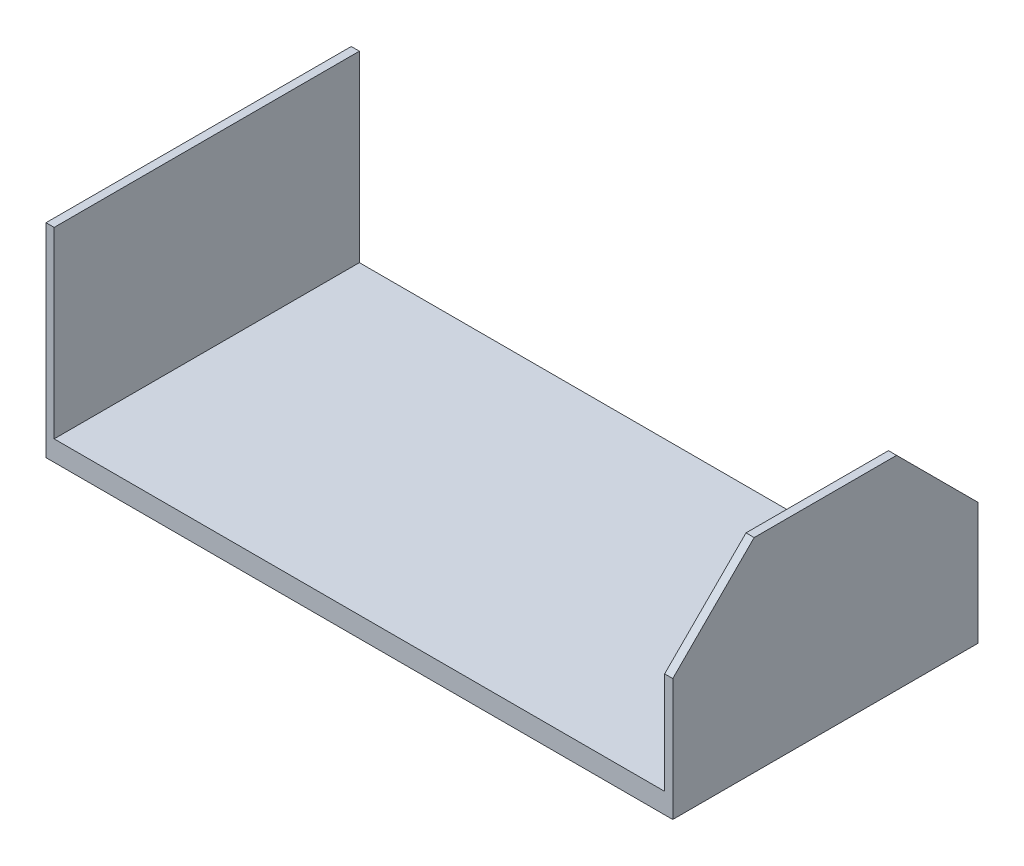
ISO-10303-21;
HEADER;
FILE_DESCRIPTION(('STEP AP214'),'2;1');
FILE_NAME('part.step','',(''),(''),'','','');
FILE_SCHEMA(('AUTOMOTIVE_DESIGN { 1 0 10303 214 1 1 1 1 }'));
ENDSEC;
DATA;
#1=APPLICATION_CONTEXT('core data for automotive mechanical design processes');
#2=APPLICATION_PROTOCOL_DEFINITION('international standard','automotive_design',2000,#1);
#3=PRODUCT_CONTEXT('',#1,'mechanical');
#4=PRODUCT('Part','Part','',(#3));
#5=PRODUCT_RELATED_PRODUCT_CATEGORY('part','',(#4));
#6=PRODUCT_DEFINITION_FORMATION('','',#4);
#7=PRODUCT_DEFINITION_CONTEXT('part definition',#1,'design');
#8=PRODUCT_DEFINITION('design','',#6,#7);
#9=PRODUCT_DEFINITION_SHAPE('','',#8);
#10=(LENGTH_UNIT() NAMED_UNIT(*) SI_UNIT(.MILLI.,.METRE.));
#11=(NAMED_UNIT(*) PLANE_ANGLE_UNIT() SI_UNIT($,.RADIAN.));
#12=(NAMED_UNIT(*) SI_UNIT($,.STERADIAN.) SOLID_ANGLE_UNIT());
#13=UNCERTAINTY_MEASURE_WITH_UNIT(LENGTH_MEASURE(1.E-05),#10,'distance_accuracy_value','');
#14=(GEOMETRIC_REPRESENTATION_CONTEXT(3) GLOBAL_UNCERTAINTY_ASSIGNED_CONTEXT((#13)) GLOBAL_UNIT_ASSIGNED_CONTEXT((#10,
#11,#12)) REPRESENTATION_CONTEXT('',''));
#15=CARTESIAN_POINT('',(0.,0.,0.));
#16=DIRECTION('',(0.,0.,1.));
#17=DIRECTION('',(1.,0.,0.));
#18=AXIS2_PLACEMENT_3D('',#15,#16,#17);
#19=CARTESIAN_POINT('',(75.,5.,37.5));
#20=DIRECTION('',(0.,0.,-1.));
#21=DIRECTION('',(-1.,0.,0.));
#22=AXIS2_PLACEMENT_3D('',#19,#20,#21);
#23=PLANE('',#22);
#24=DIRECTION('',(0.,1.,0.));
#25=VECTOR('',#24,1.);
#26=CARTESIAN_POINT('',(77.,0.,37.5));
#27=LINE('',#26,#25);
#28=CARTESIAN_POINT('',(77.,0.,37.5));
#29=VERTEX_POINT('',#28);
#30=CARTESIAN_POINT('',(77.,30.,37.5));
#31=VERTEX_POINT('',#30);
#32=EDGE_CURVE('E113',#29,#31,#27,.T.);
#33=ORIENTED_EDGE('',*,*,#32,.T.);
#34=DIRECTION('',(-1.,0.,0.));
#35=VECTOR('',#34,1.);
#36=CARTESIAN_POINT('',(75.,30.,37.5));
#37=LINE('',#36,#35);
#38=CARTESIAN_POINT('',(75.,30.,37.5));
#39=VERTEX_POINT('',#38);
#40=EDGE_CURVE('E11',#31,#39,#37,.T.);
#41=ORIENTED_EDGE('',*,*,#40,.T.);
#42=DIRECTION('',(0.,1.,0.));
#43=VECTOR('',#42,1.);
#44=CARTESIAN_POINT('',(75.,0.,37.5));
#45=LINE('',#44,#43);
#46=CARTESIAN_POINT('',(75.,5.,37.5));
#47=VERTEX_POINT('',#46);
#48=EDGE_CURVE('E143',#47,#39,#45,.T.);
#49=ORIENTED_EDGE('',*,*,#48,.F.);
#50=DIRECTION('',(1.,0.,0.));
#51=VECTOR('',#50,1.);
#52=CARTESIAN_POINT('',(75.,5.,37.5));
#53=LINE('',#52,#51);
#54=CARTESIAN_POINT('',(-75.,5.,37.5));
#55=VERTEX_POINT('',#54);
#56=EDGE_CURVE('E166',#55,#47,#53,.T.);
#57=ORIENTED_EDGE('',*,*,#56,.F.);
#58=DIRECTION('',(0.,1.,0.));
#59=VECTOR('',#58,1.);
#60=CARTESIAN_POINT('',(-75.,0.,37.5));
#61=LINE('',#60,#59);
#62=CARTESIAN_POINT('',(-75.,50.,37.5));
#63=VERTEX_POINT('',#62);
#64=EDGE_CURVE('E134',#55,#63,#61,.T.);
#65=ORIENTED_EDGE('',*,*,#64,.T.);
#66=DIRECTION('',(1.,0.,0.));
#67=VECTOR('',#66,1.);
#68=CARTESIAN_POINT('',(-77.,50.,37.5));
#69=LINE('',#68,#67);
#70=CARTESIAN_POINT('',(-77.,50.,37.5));
#71=VERTEX_POINT('',#70);
#72=EDGE_CURVE('E122',#71,#63,#69,.T.);
#73=ORIENTED_EDGE('',*,*,#72,.F.);
#74=DIRECTION('',(0.,1.,0.));
#75=VECTOR('',#74,1.);
#76=CARTESIAN_POINT('',(-77.,0.,37.5));
#77=LINE('',#76,#75);
#78=CARTESIAN_POINT('',(-77.,0.,37.5));
#79=VERTEX_POINT('',#78);
#80=EDGE_CURVE('E116',#79,#71,#77,.T.);
#81=ORIENTED_EDGE('',*,*,#80,.F.);
#82=DIRECTION('',(1.,0.,0.));
#83=VECTOR('',#82,1.);
#84=CARTESIAN_POINT('',(75.,0.,37.5));
#85=LINE('',#84,#83);
#86=EDGE_CURVE('E112',#79,#29,#85,.T.);
#87=ORIENTED_EDGE('',*,*,#86,.T.);
#88=EDGE_LOOP('',(#33,#41,#49,#57,#65,#73,#81,#87));
#89=FACE_BOUND('',#88,.T.);
#90=ADVANCED_FACE('F33',(#89),#23,.F.);
#91=CARTESIAN_POINT('',(75.,5.,-37.5));
#92=DIRECTION('',(0.,0.,1.));
#93=DIRECTION('',(1.,0.,0.));
#94=AXIS2_PLACEMENT_3D('',#91,#92,#93);
#95=PLANE('',#94);
#96=DIRECTION('',(0.,-1.,0.));
#97=VECTOR('',#96,1.);
#98=CARTESIAN_POINT('',(75.,0.,-37.5));
#99=LINE('',#98,#97);
#100=CARTESIAN_POINT('',(75.,29.9999999999999,-37.5));
#101=VERTEX_POINT('',#100);
#102=CARTESIAN_POINT('',(75.,5.,-37.5));
#103=VERTEX_POINT('',#102);
#104=EDGE_CURVE('E138',#101,#103,#99,.T.);
#105=ORIENTED_EDGE('',*,*,#104,.F.);
#106=DIRECTION('',(1.,0.,0.));
#107=VECTOR('',#106,1.);
#108=CARTESIAN_POINT('',(77.,29.9999999999999,-37.5));
#109=LINE('',#108,#107);
#110=CARTESIAN_POINT('',(77.,29.9999999999999,-37.5));
#111=VERTEX_POINT('',#110);
#112=EDGE_CURVE('E56',#101,#111,#109,.T.);
#113=ORIENTED_EDGE('',*,*,#112,.T.);
#114=DIRECTION('',(0.,-1.,0.));
#115=VECTOR('',#114,1.);
#116=CARTESIAN_POINT('',(77.,0.,-37.5));
#117=LINE('',#116,#115);
#118=CARTESIAN_POINT('',(77.,0.,-37.5));
#119=VERTEX_POINT('',#118);
#120=EDGE_CURVE('E146',#111,#119,#117,.T.);
#121=ORIENTED_EDGE('',*,*,#120,.T.);
#122=DIRECTION('',(-1.,0.,0.));
#123=VECTOR('',#122,1.);
#124=CARTESIAN_POINT('',(75.,0.,-37.5));
#125=LINE('',#124,#123);
#126=CARTESIAN_POINT('',(-77.,0.,-37.5));
#127=VERTEX_POINT('',#126);
#128=EDGE_CURVE('E121',#119,#127,#125,.T.);
#129=ORIENTED_EDGE('',*,*,#128,.T.);
#130=DIRECTION('',(0.,-1.,0.));
#131=VECTOR('',#130,1.);
#132=CARTESIAN_POINT('',(-77.,0.,-37.5));
#133=LINE('',#132,#131);
#134=CARTESIAN_POINT('',(-77.,50.,-37.5));
#135=VERTEX_POINT('',#134);
#136=EDGE_CURVE('E147',#135,#127,#133,.T.);
#137=ORIENTED_EDGE('',*,*,#136,.F.);
#138=DIRECTION('',(1.,0.,0.));
#139=VECTOR('',#138,1.);
#140=CARTESIAN_POINT('',(-77.,50.,-37.5));
#141=LINE('',#140,#139);
#142=CARTESIAN_POINT('',(-75.,50.,-37.5));
#143=VERTEX_POINT('',#142);
#144=EDGE_CURVE('E155',#135,#143,#141,.T.);
#145=ORIENTED_EDGE('',*,*,#144,.T.);
#146=DIRECTION('',(0.,-1.,0.));
#147=VECTOR('',#146,1.);
#148=CARTESIAN_POINT('',(-75.,0.,-37.5));
#149=LINE('',#148,#147);
#150=CARTESIAN_POINT('',(-75.,5.,-37.5));
#151=VERTEX_POINT('',#150);
#152=EDGE_CURVE('E131',#143,#151,#149,.T.);
#153=ORIENTED_EDGE('',*,*,#152,.T.);
#154=DIRECTION('',(-1.,0.,0.));
#155=VECTOR('',#154,1.);
#156=CARTESIAN_POINT('',(75.,5.,-37.5));
#157=LINE('',#156,#155);
#158=EDGE_CURVE('E172',#103,#151,#157,.T.);
#159=ORIENTED_EDGE('',*,*,#158,.F.);
#160=EDGE_LOOP('',(#105,#113,#121,#129,#137,#145,#153,#159));
#161=FACE_BOUND('',#160,.T.);
#162=ADVANCED_FACE('F198',(#161),#95,.F.);
#163=CARTESIAN_POINT('',(0.,5.,0.));
#164=DIRECTION('',(0.,-1.,0.));
#165=DIRECTION('',(0.,0.,-1.));
#166=AXIS2_PLACEMENT_3D('',#163,#164,#165);
#167=PLANE('',#166);
#168=DIRECTION('',(0.,0.,1.));
#169=VECTOR('',#168,1.);
#170=CARTESIAN_POINT('',(-75.,5.,-37.5));
#171=LINE('',#170,#169);
#172=EDGE_CURVE('E163',#151,#55,#171,.T.);
#173=ORIENTED_EDGE('',*,*,#172,.T.);
#174=ORIENTED_EDGE('',*,*,#56,.T.);
#175=DIRECTION('',(0.,0.,-1.));
#176=VECTOR('',#175,1.);
#177=CARTESIAN_POINT('',(75.,5.,-37.5));
#178=LINE('',#177,#176);
#179=EDGE_CURVE('E169',#47,#103,#178,.T.);
#180=ORIENTED_EDGE('',*,*,#179,.T.);
#181=ORIENTED_EDGE('',*,*,#158,.T.);
#182=EDGE_LOOP('',(#173,#174,#180,#181));
#183=FACE_BOUND('',#182,.T.);
#184=ADVANCED_FACE('F201',(#183),#167,.F.);
#185=CARTESIAN_POINT('',(0.,0.,0.));
#186=DIRECTION('',(0.,-1.,0.));
#187=DIRECTION('',(0.,0.,-1.));
#188=AXIS2_PLACEMENT_3D('',#185,#186,#187);
#189=PLANE('',#188);
#190=ORIENTED_EDGE('',*,*,#86,.F.);
#191=DIRECTION('',(0.,0.,1.));
#192=VECTOR('',#191,1.);
#193=CARTESIAN_POINT('',(-77.,0.,-37.5));
#194=LINE('',#193,#192);
#195=EDGE_CURVE('E150',#127,#79,#194,.T.);
#196=ORIENTED_EDGE('',*,*,#195,.F.);
#197=ORIENTED_EDGE('',*,*,#128,.F.);
#198=DIRECTION('',(0.,0.,1.));
#199=VECTOR('',#198,1.);
#200=CARTESIAN_POINT('',(77.,0.,-37.5));
#201=LINE('',#200,#199);
#202=EDGE_CURVE('E126',#119,#29,#201,.T.);
#203=ORIENTED_EDGE('',*,*,#202,.T.);
#204=EDGE_LOOP('',(#190,#196,#197,#203));
#205=FACE_BOUND('',#204,.T.);
#206=ADVANCED_FACE('F130',(#205),#189,.T.);
#207=CARTESIAN_POINT('',(-75.,0.,0.));
#208=DIRECTION('',(1.,0.,0.));
#209=DIRECTION('',(0.,0.,-1.));
#210=AXIS2_PLACEMENT_3D('',#207,#208,#209);
#211=PLANE('',#210);
#212=ORIENTED_EDGE('',*,*,#172,.F.);
#213=ORIENTED_EDGE('',*,*,#152,.F.);
#214=DIRECTION('',(0.,0.,-1.));
#215=VECTOR('',#214,1.);
#216=CARTESIAN_POINT('',(-75.,50.,-37.5));
#217=LINE('',#216,#215);
#218=EDGE_CURVE('E151',#63,#143,#217,.T.);
#219=ORIENTED_EDGE('',*,*,#218,.F.);
#220=ORIENTED_EDGE('',*,*,#64,.F.);
#221=EDGE_LOOP('',(#212,#213,#219,#220));
#222=FACE_BOUND('',#221,.T.);
#223=ADVANCED_FACE('F218',(#222),#211,.T.);
#224=CARTESIAN_POINT('',(-77.,50.,-37.5));
#225=DIRECTION('',(0.,-1.,0.));
#226=DIRECTION('',(0.,0.,-1.));
#227=AXIS2_PLACEMENT_3D('',#224,#225,#226);
#228=PLANE('',#227);
#229=ORIENTED_EDGE('',*,*,#218,.T.);
#230=ORIENTED_EDGE('',*,*,#144,.F.);
#231=DIRECTION('',(0.,0.,-1.));
#232=VECTOR('',#231,1.);
#233=CARTESIAN_POINT('',(-77.,50.,-37.5));
#234=LINE('',#233,#232);
#235=EDGE_CURVE('E154',#71,#135,#234,.T.);
#236=ORIENTED_EDGE('',*,*,#235,.F.);
#237=ORIENTED_EDGE('',*,*,#72,.T.);
#238=EDGE_LOOP('',(#229,#230,#236,#237));
#239=FACE_BOUND('',#238,.T.);
#240=ADVANCED_FACE('F221',(#239),#228,.F.);
#241=CARTESIAN_POINT('',(-77.,0.,0.));
#242=DIRECTION('',(1.,0.,0.));
#243=DIRECTION('',(0.,0.,-1.));
#244=AXIS2_PLACEMENT_3D('',#241,#242,#243);
#245=PLANE('',#244);
#246=ORIENTED_EDGE('',*,*,#136,.T.);
#247=ORIENTED_EDGE('',*,*,#195,.T.);
#248=ORIENTED_EDGE('',*,*,#80,.T.);
#249=ORIENTED_EDGE('',*,*,#235,.T.);
#250=EDGE_LOOP('',(#246,#247,#248,#249));
#251=FACE_BOUND('',#250,.T.);
#252=ADVANCED_FACE('F224',(#251),#245,.F.);
#253=CARTESIAN_POINT('',(75.,0.,0.));
#254=DIRECTION('',(-1.,0.,0.));
#255=DIRECTION('',(0.,0.,-1.));
#256=AXIS2_PLACEMENT_3D('',#253,#254,#255);
#257=PLANE('',#256);
#258=DIRECTION('',(0.,0.,-1.));
#259=VECTOR('',#258,1.);
#260=CARTESIAN_POINT('',(75.,50.,-37.5));
#261=LINE('',#260,#259);
#262=CARTESIAN_POINT('',(75.,50.,17.4999999999999));
#263=VERTEX_POINT('',#262);
#264=CARTESIAN_POINT('',(75.,50.,-17.5));
#265=VERTEX_POINT('',#264);
#266=EDGE_CURVE('E140',#263,#265,#261,.T.);
#267=ORIENTED_EDGE('',*,*,#266,.T.);
#268=DIRECTION('',(0.,-0.707106781186549,-0.707106781186547));
#269=VECTOR('',#268,1.);
#270=CARTESIAN_POINT('',(75.,33.7499999999999,-33.75));
#271=LINE('',#270,#269);
#272=EDGE_CURVE('E183',#265,#101,#271,.T.);
#273=ORIENTED_EDGE('',*,*,#272,.T.);
#274=ORIENTED_EDGE('',*,*,#104,.T.);
#275=ORIENTED_EDGE('',*,*,#179,.F.);
#276=ORIENTED_EDGE('',*,*,#48,.T.);
#277=DIRECTION('',(0.,0.707106781186547,-0.707106781186549));
#278=VECTOR('',#277,1.);
#279=CARTESIAN_POINT('',(75.,33.75,33.7499999999999));
#280=LINE('',#279,#278);
#281=EDGE_CURVE('E181',#39,#263,#280,.T.);
#282=ORIENTED_EDGE('',*,*,#281,.T.);
#283=EDGE_LOOP('',(#267,#273,#274,#275,#276,#282));
#284=FACE_BOUND('',#283,.T.);
#285=ADVANCED_FACE('F196',(#284),#257,.T.);
#286=CARTESIAN_POINT('',(77.,50.,-37.5));
#287=DIRECTION('',(0.,1.,0.));
#288=DIRECTION('',(0.,0.,1.));
#289=AXIS2_PLACEMENT_3D('',#286,#287,#288);
#290=PLANE('',#289);
#291=DIRECTION('',(0.,0.,-1.));
#292=VECTOR('',#291,1.);
#293=CARTESIAN_POINT('',(77.,50.,-37.5));
#294=LINE('',#293,#292);
#295=CARTESIAN_POINT('',(77.,50.,17.4999999999999));
#296=VERTEX_POINT('',#295);
#297=CARTESIAN_POINT('',(77.,50.,-17.5));
#298=VERTEX_POINT('',#297);
#299=EDGE_CURVE('E127',#296,#298,#294,.T.);
#300=ORIENTED_EDGE('',*,*,#299,.T.);
#301=DIRECTION('',(-1.,0.,0.));
#302=VECTOR('',#301,1.);
#303=CARTESIAN_POINT('',(75.,50.,-17.5));
#304=LINE('',#303,#302);
#305=EDGE_CURVE('E178',#298,#265,#304,.T.);
#306=ORIENTED_EDGE('',*,*,#305,.T.);
#307=ORIENTED_EDGE('',*,*,#266,.F.);
#308=DIRECTION('',(1.,0.,0.));
#309=VECTOR('',#308,1.);
#310=CARTESIAN_POINT('',(77.,50.,17.4999999999999));
#311=LINE('',#310,#309);
#312=EDGE_CURVE('E174',#263,#296,#311,.T.);
#313=ORIENTED_EDGE('',*,*,#312,.T.);
#314=EDGE_LOOP('',(#300,#306,#307,#313));
#315=FACE_BOUND('',#314,.T.);
#316=ADVANCED_FACE('F191',(#315),#290,.T.);
#317=CARTESIAN_POINT('',(77.,0.,0.));
#318=DIRECTION('',(-1.,0.,0.));
#319=DIRECTION('',(0.,0.,-1.));
#320=AXIS2_PLACEMENT_3D('',#317,#318,#319);
#321=PLANE('',#320);
#322=ORIENTED_EDGE('',*,*,#120,.F.);
#323=DIRECTION('',(0.,0.707106781186549,0.707106781186547));
#324=VECTOR('',#323,1.);
#325=CARTESIAN_POINT('',(77.,50.,-17.5));
#326=LINE('',#325,#324);
#327=EDGE_CURVE('E41',#111,#298,#326,.T.);
#328=ORIENTED_EDGE('',*,*,#327,.T.);
#329=ORIENTED_EDGE('',*,*,#299,.F.);
#330=DIRECTION('',(0.,-0.707106781186547,0.707106781186549));
#331=VECTOR('',#330,1.);
#332=CARTESIAN_POINT('',(77.,30.,37.5));
#333=LINE('',#332,#331);
#334=EDGE_CURVE('E48',#296,#31,#333,.T.);
#335=ORIENTED_EDGE('',*,*,#334,.T.);
#336=ORIENTED_EDGE('',*,*,#32,.F.);
#337=ORIENTED_EDGE('',*,*,#202,.F.);
#338=EDGE_LOOP('',(#322,#328,#329,#335,#336,#337));
#339=FACE_BOUND('',#338,.T.);
#340=ADVANCED_FACE('F125',(#339),#321,.F.);
#341=CARTESIAN_POINT('',(77.,50.,-17.5));
#342=DIRECTION('',(0.,0.707106781186547,-0.707106781186549));
#343=DIRECTION('',(1.,0.,0.));
#344=AXIS2_PLACEMENT_3D('',#341,#342,#343);
#345=PLANE('',#344);
#346=ORIENTED_EDGE('',*,*,#327,.F.);
#347=ORIENTED_EDGE('',*,*,#112,.F.);
#348=ORIENTED_EDGE('',*,*,#272,.F.);
#349=ORIENTED_EDGE('',*,*,#305,.F.);
#350=EDGE_LOOP('',(#346,#347,#348,#349));
#351=FACE_BOUND('',#350,.T.);
#352=ADVANCED_FACE('F194',(#351),#345,.T.);
#353=CARTESIAN_POINT('',(75.,30.,37.5));
#354=DIRECTION('',(0.,0.707106781186549,0.707106781186547));
#355=DIRECTION('',(1.,0.,0.));
#356=AXIS2_PLACEMENT_3D('',#353,#354,#355);
#357=PLANE('',#356);
#358=ORIENTED_EDGE('',*,*,#334,.F.);
#359=ORIENTED_EDGE('',*,*,#312,.F.);
#360=ORIENTED_EDGE('',*,*,#281,.F.);
#361=ORIENTED_EDGE('',*,*,#40,.F.);
#362=EDGE_LOOP('',(#358,#359,#360,#361));
#363=FACE_BOUND('',#362,.T.);
#364=ADVANCED_FACE('F35',(#363),#357,.T.);
#365=CLOSED_SHELL('',(#90,#162,#184,#206,#223,#240,#252,#285,#316,#340,#352,#364));
#366=MANIFOLD_SOLID_BREP('B2',#365);
#367=ADVANCED_BREP_SHAPE_REPRESENTATION('',(#18,#366),#14);
#368=SHAPE_DEFINITION_REPRESENTATION(#9,#367);
ENDSEC;
END-ISO-10303-21;
